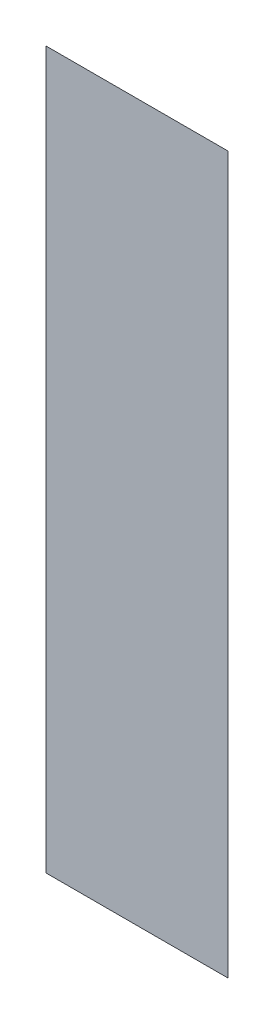
ISO-10303-21;
HEADER;
FILE_DESCRIPTION(('STEP AP214'),'2;1');
FILE_NAME('part.step','',(''),(''),'','','');
FILE_SCHEMA(('AUTOMOTIVE_DESIGN { 1 0 10303 214 1 1 1 1 }'));
ENDSEC;
DATA;
#1=APPLICATION_CONTEXT('core data for automotive mechanical design processes');
#2=APPLICATION_PROTOCOL_DEFINITION('international standard','automotive_design',2000,#1);
#3=PRODUCT_CONTEXT('',#1,'mechanical');
#4=PRODUCT('Part','Part','',(#3));
#5=PRODUCT_RELATED_PRODUCT_CATEGORY('part','',(#4));
#6=PRODUCT_DEFINITION_FORMATION('','',#4);
#7=PRODUCT_DEFINITION_CONTEXT('part definition',#1,'design');
#8=PRODUCT_DEFINITION('design','',#6,#7);
#9=PRODUCT_DEFINITION_SHAPE('','',#8);
#10=(LENGTH_UNIT() NAMED_UNIT(*) SI_UNIT(.MILLI.,.METRE.));
#11=(NAMED_UNIT(*) PLANE_ANGLE_UNIT() SI_UNIT($,.RADIAN.));
#12=(NAMED_UNIT(*) SI_UNIT($,.STERADIAN.) SOLID_ANGLE_UNIT());
#13=UNCERTAINTY_MEASURE_WITH_UNIT(LENGTH_MEASURE(1.E-05),#10,'distance_accuracy_value','');
#14=(GEOMETRIC_REPRESENTATION_CONTEXT(3) GLOBAL_UNCERTAINTY_ASSIGNED_CONTEXT((#13)) GLOBAL_UNIT_ASSIGNED_CONTEXT((#10,
#11,#12)) REPRESENTATION_CONTEXT('',''));
#15=CARTESIAN_POINT('',(0.,0.,0.));
#16=DIRECTION('',(0.,0.,1.));
#17=DIRECTION('',(1.,0.,0.));
#18=AXIS2_PLACEMENT_3D('',#15,#16,#17);
#19=CARTESIAN_POINT('',(-0.08541934484065,0.899692190159,0.00015));
#20=DIRECTION('',(0.,0.,1.));
#21=DIRECTION('',(1.,0.,0.));
#22=AXIS2_PLACEMENT_3D('',#19,#20,#21);
#23=PLANE('',#22);
#24=CARTESIAN_POINT('',(-0.08875331391565,0.899692190159,0.00015));
#25=DIRECTION('',(1.,0.,0.));
#26=VECTOR('',#25,1.);
#27=LINE('',#24,#26);
#28=CARTESIAN_POINT('',(-0.08875331391565,0.899692190159,7.5E-05));
#29=VERTEX_POINT('',#28);
#30=CARTESIAN_POINT('',(-0.08208537576565,0.899692190159,7.5E-05));
#31=VERTEX_POINT('',#30);
#32=EDGE_CURVE('E41',#29,#31,#27,.T.);
#33=ORIENTED_EDGE('',*,*,#32,.T.);
#34=CARTESIAN_POINT('',(-0.08208537576565,0.899692190159,0.00015));
#35=DIRECTION('',(0.,1.,0.));
#36=VECTOR('',#35,1.);
#37=LINE('',#34,#36);
#38=CARTESIAN_POINT('',(-0.08208537576565,0.92595557828,7.5E-05));
#39=VERTEX_POINT('',#38);
#40=EDGE_CURVE('E28',#31,#39,#37,.T.);
#41=ORIENTED_EDGE('',*,*,#40,.T.);
#42=CARTESIAN_POINT('',(-0.08208537576565,0.92595557828,0.00015));
#43=DIRECTION('',(-1.,0.,0.));
#44=VECTOR('',#43,1.);
#45=LINE('',#42,#44);
#46=CARTESIAN_POINT('',(-0.08875331391565,0.92595557828,7.5E-05));
#47=VERTEX_POINT('',#46);
#48=EDGE_CURVE('E11',#39,#47,#45,.T.);
#49=ORIENTED_EDGE('',*,*,#48,.T.);
#50=CARTESIAN_POINT('',(-0.08875331391565,0.92595557828,0.00015));
#51=DIRECTION('',(0.,-1.,0.));
#52=VECTOR('',#51,1.);
#53=LINE('',#50,#52);
#54=EDGE_CURVE('E44',#47,#29,#53,.T.);
#55=ORIENTED_EDGE('',*,*,#54,.T.);
#56=EDGE_LOOP('',(#33,#41,#49,#55));
#57=FACE_BOUND('',#56,.T.);
#58=ADVANCED_FACE('F17',(#57),#23,.T.);
#59=CARTESIAN_POINT('',(-0.08541934484065,0.899692190159,0.));
#60=DIRECTION('',(0.,0.,1.));
#61=DIRECTION('',(1.,0.,0.));
#62=AXIS2_PLACEMENT_3D('',#59,#60,#61);
#63=PLANE('',#62);
#64=ORIENTED_EDGE('',*,*,#40,.F.);
#65=ORIENTED_EDGE('',*,*,#32,.F.);
#66=ORIENTED_EDGE('',*,*,#54,.F.);
#67=ORIENTED_EDGE('',*,*,#48,.F.);
#68=EDGE_LOOP('',(#64,#65,#66,#67));
#69=FACE_BOUND('',#68,.T.);
#70=ADVANCED_FACE('F46',(#69),#63,.F.);
#71=CLOSED_SHELL('',(#58,#70));
#72=MANIFOLD_SOLID_BREP('B1',#71);
#73=ADVANCED_BREP_SHAPE_REPRESENTATION('',(#18,#72),#14);
#74=SHAPE_DEFINITION_REPRESENTATION(#9,#73);
ENDSEC;
END-ISO-10303-21;
